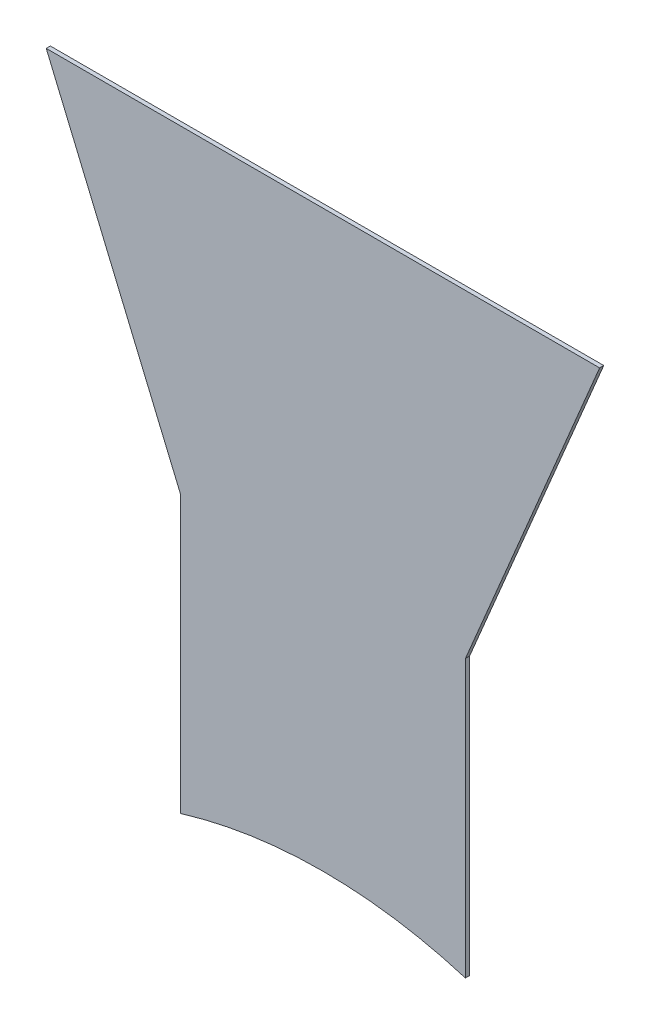
ISO-10303-21;
HEADER;
FILE_DESCRIPTION(('STEP AP214'),'2;1');
FILE_NAME('part.step','',(''),(''),'','','');
FILE_SCHEMA(('AUTOMOTIVE_DESIGN { 1 0 10303 214 1 1 1 1 }'));
ENDSEC;
DATA;
#1=APPLICATION_CONTEXT('core data for automotive mechanical design processes');
#2=APPLICATION_PROTOCOL_DEFINITION('international standard','automotive_design',2000,#1);
#3=PRODUCT_CONTEXT('',#1,'mechanical');
#4=PRODUCT('Part','Part','',(#3));
#5=PRODUCT_RELATED_PRODUCT_CATEGORY('part','',(#4));
#6=PRODUCT_DEFINITION_FORMATION('','',#4);
#7=PRODUCT_DEFINITION_CONTEXT('part definition',#1,'design');
#8=PRODUCT_DEFINITION('design','',#6,#7);
#9=PRODUCT_DEFINITION_SHAPE('','',#8);
#10=(LENGTH_UNIT() NAMED_UNIT(*) SI_UNIT(.MILLI.,.METRE.));
#11=(NAMED_UNIT(*) PLANE_ANGLE_UNIT() SI_UNIT($,.RADIAN.));
#12=(NAMED_UNIT(*) SI_UNIT($,.STERADIAN.) SOLID_ANGLE_UNIT());
#13=UNCERTAINTY_MEASURE_WITH_UNIT(LENGTH_MEASURE(1.E-05),#10,'distance_accuracy_value','');
#14=(GEOMETRIC_REPRESENTATION_CONTEXT(3) GLOBAL_UNCERTAINTY_ASSIGNED_CONTEXT((#13)) GLOBAL_UNIT_ASSIGNED_CONTEXT((#10,
#11,#12)) REPRESENTATION_CONTEXT('',''));
#15=CARTESIAN_POINT('',(0.,0.,0.));
#16=DIRECTION('',(0.,0.,1.));
#17=DIRECTION('',(1.,0.,0.));
#18=AXIS2_PLACEMENT_3D('',#15,#16,#17);
#19=CARTESIAN_POINT('',(-101.6,390.165381262137,1.51892));
#20=DIRECTION('',(0.921642532872697,0.38804,0.));
#21=DIRECTION('',(-0.38804,0.921642532872697,0.));
#22=AXIS2_PLACEMENT_3D('',#19,#20,#21);
#23=PLANE('',#22);
#24=DIRECTION('',(0.38804,-0.921642532872697,0.));
#25=VECTOR('',#24,1.);
#26=CARTESIAN_POINT('',(-101.6,390.165381262137,0.));
#27=LINE('',#26,#25);
#28=CARTESIAN_POINT('',(-101.6,390.165381262137,0.));
#29=VERTEX_POINT('',#28);
#30=CARTESIAN_POINT('',(-52.31892,273.116779587305,0.));
#31=VERTEX_POINT('',#30);
#32=EDGE_CURVE('E128',#29,#31,#27,.T.);
#33=ORIENTED_EDGE('',*,*,#32,.T.);
#34=DIRECTION('',(0.,0.,-1.));
#35=VECTOR('',#34,1.);
#36=CARTESIAN_POINT('',(-52.31892,273.116779587305,1.51892));
#37=LINE('',#36,#35);
#38=CARTESIAN_POINT('',(-52.31892,273.116779587305,1.51892));
#39=VERTEX_POINT('',#38);
#40=EDGE_CURVE('E11',#39,#31,#37,.T.);
#41=ORIENTED_EDGE('',*,*,#40,.F.);
#42=DIRECTION('',(0.38804,-0.921642532872697,0.));
#43=VECTOR('',#42,1.);
#44=CARTESIAN_POINT('',(-101.6,390.165381262137,1.51892));
#45=LINE('',#44,#43);
#46=CARTESIAN_POINT('',(-101.6,390.165381262137,1.51892));
#47=VERTEX_POINT('',#46);
#48=EDGE_CURVE('E144',#47,#39,#45,.T.);
#49=ORIENTED_EDGE('',*,*,#48,.F.);
#50=DIRECTION('',(0.,0.,-1.));
#51=VECTOR('',#50,1.);
#52=CARTESIAN_POINT('',(-101.6,390.165381262137,1.51892));
#53=LINE('',#52,#51);
#54=EDGE_CURVE('E124',#47,#29,#53,.T.);
#55=ORIENTED_EDGE('',*,*,#54,.T.);
#56=EDGE_LOOP('',(#33,#41,#49,#55));
#57=FACE_BOUND('',#56,.T.);
#58=ADVANCED_FACE('F39',(#57),#23,.F.);
#59=CARTESIAN_POINT('',(-52.31892,171.516779587304,1.51892));
#60=DIRECTION('',(1.,0.,0.));
#61=DIRECTION('',(0.,0.,-1.));
#62=AXIS2_PLACEMENT_3D('',#59,#60,#61);
#63=PLANE('',#62);
#64=DIRECTION('',(0.,-1.,0.));
#65=VECTOR('',#64,1.);
#66=CARTESIAN_POINT('',(-52.31892,171.516779587304,0.));
#67=LINE('',#66,#65);
#68=CARTESIAN_POINT('',(-52.31892,171.516779587304,0.));
#69=VERTEX_POINT('',#68);
#70=EDGE_CURVE('E132',#31,#69,#67,.T.);
#71=ORIENTED_EDGE('',*,*,#70,.T.);
#72=DIRECTION('',(0.,0.,-1.));
#73=VECTOR('',#72,1.);
#74=CARTESIAN_POINT('',(-52.31892,171.516779587304,1.51892));
#75=LINE('',#74,#73);
#76=CARTESIAN_POINT('',(-52.31892,171.516779587304,1.51892));
#77=VERTEX_POINT('',#76);
#78=EDGE_CURVE('E48',#77,#69,#75,.T.);
#79=ORIENTED_EDGE('',*,*,#78,.F.);
#80=DIRECTION('',(0.,-1.,0.));
#81=VECTOR('',#80,1.);
#82=CARTESIAN_POINT('',(-52.31892,171.516779587304,1.51892));
#83=LINE('',#82,#81);
#84=EDGE_CURVE('E93',#39,#77,#83,.T.);
#85=ORIENTED_EDGE('',*,*,#84,.F.);
#86=ORIENTED_EDGE('',*,*,#40,.T.);
#87=EDGE_LOOP('',(#71,#79,#85,#86));
#88=FACE_BOUND('',#87,.T.);
#89=ADVANCED_FACE('F172',(#88),#63,.F.);
#90=CARTESIAN_POINT('',(0.,0.,1.51892));
#91=DIRECTION('',(0.,0.,-1.));
#92=DIRECTION('',(-1.,0.,0.));
#93=AXIS2_PLACEMENT_3D('',#90,#91,#92);
#94=CYLINDRICAL_SURFACE('',#93,179.31892);
#95=CARTESIAN_POINT('',(0.,0.,0.));
#96=DIRECTION('',(0.,0.,-1.));
#97=DIRECTION('',(1.,0.,0.));
#98=AXIS2_PLACEMENT_3D('',#95,#96,#97);
#99=CIRCLE('',#98,179.31892);
#100=CARTESIAN_POINT('',(52.31892,171.516779587304,0.));
#101=VERTEX_POINT('',#100);
#102=EDGE_CURVE('E135',#69,#101,#99,.T.);
#103=ORIENTED_EDGE('',*,*,#102,.T.);
#104=DIRECTION('',(0.,0.,-1.));
#105=VECTOR('',#104,1.);
#106=CARTESIAN_POINT('',(52.31892,171.516779587304,1.51892));
#107=LINE('',#106,#105);
#108=CARTESIAN_POINT('',(52.31892,171.516779587304,1.51892));
#109=VERTEX_POINT('',#108);
#110=EDGE_CURVE('E117',#109,#101,#107,.T.);
#111=ORIENTED_EDGE('',*,*,#110,.F.);
#112=CARTESIAN_POINT('',(0.,0.,1.51892));
#113=DIRECTION('',(0.,0.,-1.));
#114=DIRECTION('',(1.,0.,0.));
#115=AXIS2_PLACEMENT_3D('',#112,#113,#114);
#116=CIRCLE('',#115,179.31892);
#117=EDGE_CURVE('E106',#77,#109,#116,.T.);
#118=ORIENTED_EDGE('',*,*,#117,.F.);
#119=ORIENTED_EDGE('',*,*,#78,.T.);
#120=EDGE_LOOP('',(#103,#111,#118,#119));
#121=FACE_BOUND('',#120,.T.);
#122=ADVANCED_FACE('F154',(#121),#94,.F.);
#123=CARTESIAN_POINT('',(52.31892,171.516779587304,1.51892));
#124=DIRECTION('',(-1.,0.,0.));
#125=DIRECTION('',(0.,0.,1.));
#126=AXIS2_PLACEMENT_3D('',#123,#124,#125);
#127=PLANE('',#126);
#128=DIRECTION('',(0.,1.,0.));
#129=VECTOR('',#128,1.);
#130=CARTESIAN_POINT('',(52.31892,171.516779587304,0.));
#131=LINE('',#130,#129);
#132=CARTESIAN_POINT('',(52.31892,273.116779587305,0.));
#133=VERTEX_POINT('',#132);
#134=EDGE_CURVE('E115',#101,#133,#131,.T.);
#135=ORIENTED_EDGE('',*,*,#134,.T.);
#136=DIRECTION('',(0.,0.,-1.));
#137=VECTOR('',#136,1.);
#138=CARTESIAN_POINT('',(52.31892,273.116779587305,1.51892));
#139=LINE('',#138,#137);
#140=CARTESIAN_POINT('',(52.31892,273.116779587305,1.51892));
#141=VERTEX_POINT('',#140);
#142=EDGE_CURVE('E112',#141,#133,#139,.T.);
#143=ORIENTED_EDGE('',*,*,#142,.F.);
#144=DIRECTION('',(0.,1.,0.));
#145=VECTOR('',#144,1.);
#146=CARTESIAN_POINT('',(52.31892,171.516779587304,1.51892));
#147=LINE('',#146,#145);
#148=EDGE_CURVE('E100',#109,#141,#147,.T.);
#149=ORIENTED_EDGE('',*,*,#148,.F.);
#150=ORIENTED_EDGE('',*,*,#110,.T.);
#151=EDGE_LOOP('',(#135,#143,#149,#150));
#152=FACE_BOUND('',#151,.T.);
#153=ADVANCED_FACE('F113',(#152),#127,.F.);
#154=CARTESIAN_POINT('',(101.6,390.165381262137,1.51892));
#155=DIRECTION('',(-0.921642532872697,0.38804,0.));
#156=DIRECTION('',(-0.38804,-0.921642532872697,0.));
#157=AXIS2_PLACEMENT_3D('',#154,#155,#156);
#158=PLANE('',#157);
#159=DIRECTION('',(0.38804,0.921642532872697,0.));
#160=VECTOR('',#159,1.);
#161=CARTESIAN_POINT('',(101.6,390.165381262137,0.));
#162=LINE('',#161,#160);
#163=CARTESIAN_POINT('',(101.6,390.165381262137,0.));
#164=VERTEX_POINT('',#163);
#165=EDGE_CURVE('E79',#133,#164,#162,.T.);
#166=ORIENTED_EDGE('',*,*,#165,.T.);
#167=DIRECTION('',(0.,0.,-1.));
#168=VECTOR('',#167,1.);
#169=CARTESIAN_POINT('',(101.6,390.165381262137,1.51892));
#170=LINE('',#169,#168);
#171=CARTESIAN_POINT('',(101.6,390.165381262137,1.51892));
#172=VERTEX_POINT('',#171);
#173=EDGE_CURVE('E118',#172,#164,#170,.T.);
#174=ORIENTED_EDGE('',*,*,#173,.F.);
#175=DIRECTION('',(0.38804,0.921642532872697,0.));
#176=VECTOR('',#175,1.);
#177=CARTESIAN_POINT('',(101.6,390.165381262137,1.51892));
#178=LINE('',#177,#176);
#179=EDGE_CURVE('E104',#141,#172,#178,.T.);
#180=ORIENTED_EDGE('',*,*,#179,.F.);
#181=ORIENTED_EDGE('',*,*,#142,.T.);
#182=EDGE_LOOP('',(#166,#174,#180,#181));
#183=FACE_BOUND('',#182,.T.);
#184=ADVANCED_FACE('F120',(#183),#158,.F.);
#185=CARTESIAN_POINT('',(-101.6,390.165381262137,1.51892));
#186=DIRECTION('',(0.,-1.,0.));
#187=DIRECTION('',(0.,0.,-1.));
#188=AXIS2_PLACEMENT_3D('',#185,#186,#187);
#189=PLANE('',#188);
#190=DIRECTION('',(-1.,0.,0.));
#191=VECTOR('',#190,1.);
#192=CARTESIAN_POINT('',(-101.6,390.165381262137,0.));
#193=LINE('',#192,#191);
#194=EDGE_CURVE('E85',#164,#29,#193,.T.);
#195=ORIENTED_EDGE('',*,*,#194,.T.);
#196=ORIENTED_EDGE('',*,*,#54,.F.);
#197=DIRECTION('',(-1.,0.,0.));
#198=VECTOR('',#197,1.);
#199=CARTESIAN_POINT('',(-101.6,390.165381262137,1.51892));
#200=LINE('',#199,#198);
#201=EDGE_CURVE('E56',#172,#47,#200,.T.);
#202=ORIENTED_EDGE('',*,*,#201,.F.);
#203=ORIENTED_EDGE('',*,*,#173,.T.);
#204=EDGE_LOOP('',(#195,#196,#202,#203));
#205=FACE_BOUND('',#204,.T.);
#206=ADVANCED_FACE('F161',(#205),#189,.F.);
#207=CARTESIAN_POINT('',(0.,0.,1.51892));
#208=DIRECTION('',(0.,0.,1.));
#209=DIRECTION('',(1.,0.,0.));
#210=AXIS2_PLACEMENT_3D('',#207,#208,#209);
#211=PLANE('',#210);
#212=ORIENTED_EDGE('',*,*,#48,.T.);
#213=ORIENTED_EDGE('',*,*,#84,.T.);
#214=ORIENTED_EDGE('',*,*,#117,.T.);
#215=ORIENTED_EDGE('',*,*,#148,.T.);
#216=ORIENTED_EDGE('',*,*,#179,.T.);
#217=ORIENTED_EDGE('',*,*,#201,.T.);
#218=EDGE_LOOP('',(#212,#213,#214,#215,#216,#217));
#219=FACE_BOUND('',#218,.T.);
#220=ADVANCED_FACE('F102',(#219),#211,.T.);
#221=CARTESIAN_POINT('',(0.,0.,0.));
#222=DIRECTION('',(0.,0.,1.));
#223=DIRECTION('',(1.,0.,0.));
#224=AXIS2_PLACEMENT_3D('',#221,#222,#223);
#225=PLANE('',#224);
#226=ORIENTED_EDGE('',*,*,#32,.F.);
#227=ORIENTED_EDGE('',*,*,#194,.F.);
#228=ORIENTED_EDGE('',*,*,#165,.F.);
#229=ORIENTED_EDGE('',*,*,#134,.F.);
#230=ORIENTED_EDGE('',*,*,#102,.F.);
#231=ORIENTED_EDGE('',*,*,#70,.F.);
#232=EDGE_LOOP('',(#226,#227,#228,#229,#230,#231));
#233=FACE_BOUND('',#232,.T.);
#234=ADVANCED_FACE('F157',(#233),#225,.F.);
#235=CLOSED_SHELL('',(#58,#89,#122,#153,#184,#206,#220,#234));
#236=MANIFOLD_SOLID_BREP('B2',#235);
#237=ADVANCED_BREP_SHAPE_REPRESENTATION('',(#18,#236),#14);
#238=SHAPE_DEFINITION_REPRESENTATION(#9,#237);
ENDSEC;
END-ISO-10303-21;
